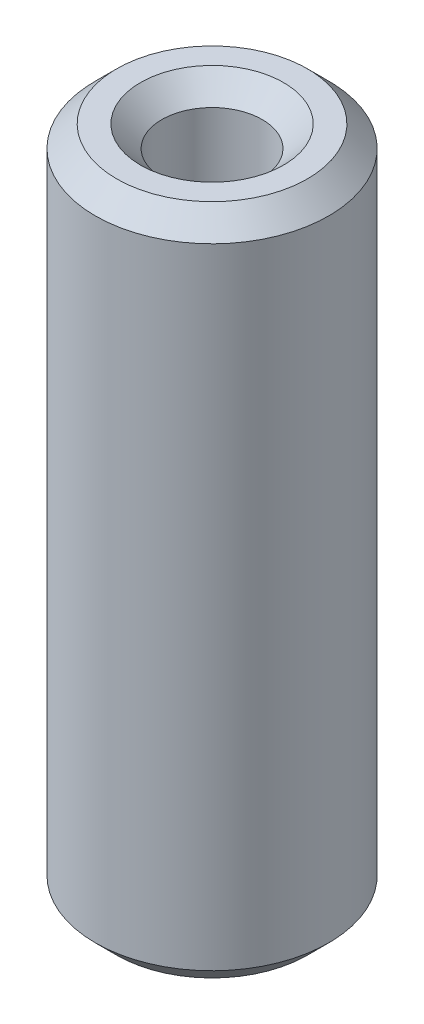
ISO-10303-21;
HEADER;
FILE_DESCRIPTION(('STEP AP214'),'2;1');
FILE_NAME('part.step','',(''),(''),'','','');
FILE_SCHEMA(('AUTOMOTIVE_DESIGN { 1 0 10303 214 1 1 1 1 }'));
ENDSEC;
DATA;
#1=APPLICATION_CONTEXT('core data for automotive mechanical design processes');
#2=APPLICATION_PROTOCOL_DEFINITION('international standard','automotive_design',2000,#1);
#3=PRODUCT_CONTEXT('',#1,'mechanical');
#4=PRODUCT('Part','Part','',(#3));
#5=PRODUCT_RELATED_PRODUCT_CATEGORY('part','',(#4));
#6=PRODUCT_DEFINITION_FORMATION('','',#4);
#7=PRODUCT_DEFINITION_CONTEXT('part definition',#1,'design');
#8=PRODUCT_DEFINITION('design','',#6,#7);
#9=PRODUCT_DEFINITION_SHAPE('','',#8);
#10=(LENGTH_UNIT() NAMED_UNIT(*) SI_UNIT(.MILLI.,.METRE.));
#11=(NAMED_UNIT(*) PLANE_ANGLE_UNIT() SI_UNIT($,.RADIAN.));
#12=(NAMED_UNIT(*) SI_UNIT($,.STERADIAN.) SOLID_ANGLE_UNIT());
#13=UNCERTAINTY_MEASURE_WITH_UNIT(LENGTH_MEASURE(1.E-05),#10,'distance_accuracy_value','');
#14=(GEOMETRIC_REPRESENTATION_CONTEXT(3) GLOBAL_UNCERTAINTY_ASSIGNED_CONTEXT((#13)) GLOBAL_UNIT_ASSIGNED_CONTEXT((#10,
#11,#12)) REPRESENTATION_CONTEXT('',''));
#15=CARTESIAN_POINT('',(0.,0.,0.));
#16=DIRECTION('',(0.,0.,1.));
#17=DIRECTION('',(1.,0.,0.));
#18=AXIS2_PLACEMENT_3D('',#15,#16,#17);
#19=CARTESIAN_POINT('',(0.,100.765719704849,0.));
#20=DIRECTION('',(0.,-1.,0.));
#21=DIRECTION('',(0.,0.,-1.));
#22=AXIS2_PLACEMENT_3D('',#19,#20,#21);
#23=CYLINDRICAL_SURFACE('',#22,17.5);
#24=CARTESIAN_POINT('',(0.,3.20181705302647,0.));
#25=DIRECTION('',(0.,1.,0.));
#26=DIRECTION('',(0.,0.,1.));
#27=AXIS2_PLACEMENT_3D('',#24,#25,#26);
#28=CIRCLE('',#27,17.5);
#29=CARTESIAN_POINT('',(0.,3.20181705302647,17.5));
#30=VERTEX_POINT('',#29);
#31=EDGE_CURVE('E10',#30,#30,#28,.T.);
#32=ORIENTED_EDGE('',*,*,#31,.T.);
#33=EDGE_LOOP('',(#32));
#34=FACE_BOUND('',#33,.T.);
#35=CARTESIAN_POINT('',(0.,97.5639026518224,0.));
#36=DIRECTION('',(0.,1.,0.));
#37=DIRECTION('',(0.,0.,1.));
#38=AXIS2_PLACEMENT_3D('',#35,#36,#37);
#39=CIRCLE('',#38,17.5);
#40=CARTESIAN_POINT('',(0.,97.5639026518224,17.5));
#41=VERTEX_POINT('',#40);
#42=EDGE_CURVE('E50',#41,#41,#39,.F.);
#43=ORIENTED_EDGE('',*,*,#42,.T.);
#44=EDGE_LOOP('',(#43));
#45=FACE_BOUND('',#44,.T.);
#46=ADVANCED_FACE('F39',(#34,#45),#23,.T.);
#47=CARTESIAN_POINT('',(0.,100.765719704849,0.));
#48=DIRECTION('',(0.,1.,0.));
#49=DIRECTION('',(0.,0.,1.));
#50=AXIS2_PLACEMENT_3D('',#47,#48,#49);
#51=PLANE('',#50);
#52=CARTESIAN_POINT('',(0.,100.765719704849,0.));
#53=DIRECTION('',(0.,1.,0.));
#54=DIRECTION('',(0.,0.,1.));
#55=AXIS2_PLACEMENT_3D('',#52,#53,#54);
#56=CIRCLE('',#55,10.7248258635014);
#57=CARTESIAN_POINT('',(0.,100.765719704849,10.7248258635014));
#58=VERTEX_POINT('',#57);
#59=EDGE_CURVE('E58',#58,#58,#56,.F.);
#60=ORIENTED_EDGE('',*,*,#59,.T.);
#61=EDGE_LOOP('',(#60));
#62=FACE_BOUND('',#61,.T.);
#63=CARTESIAN_POINT('',(0.,100.765719704849,0.));
#64=DIRECTION('',(0.,1.,0.));
#65=DIRECTION('',(0.,0.,1.));
#66=AXIS2_PLACEMENT_3D('',#63,#64,#65);
#67=CIRCLE('',#66,14.2981829469735);
#68=CARTESIAN_POINT('',(0.,100.765719704849,14.2981829469735));
#69=VERTEX_POINT('',#68);
#70=EDGE_CURVE('E61',#69,#69,#67,.T.);
#71=ORIENTED_EDGE('',*,*,#70,.T.);
#72=EDGE_LOOP('',(#71));
#73=FACE_BOUND('',#72,.T.);
#74=ADVANCED_FACE('F88',(#62,#73),#51,.T.);
#75=CARTESIAN_POINT('',(0.,0.,0.));
#76=DIRECTION('',(0.,1.,0.));
#77=DIRECTION('',(0.,0.,1.));
#78=AXIS2_PLACEMENT_3D('',#75,#76,#77);
#79=PLANE('',#78);
#80=CARTESIAN_POINT('',(0.,0.,0.));
#81=DIRECTION('',(0.,1.,0.));
#82=DIRECTION('',(0.,0.,1.));
#83=AXIS2_PLACEMENT_3D('',#80,#81,#82);
#84=CIRCLE('',#83,10.7248258635014);
#85=CARTESIAN_POINT('',(0.,0.,10.7248258635014));
#86=VERTEX_POINT('',#85);
#87=EDGE_CURVE('E51',#86,#86,#84,.T.);
#88=ORIENTED_EDGE('',*,*,#87,.T.);
#89=EDGE_LOOP('',(#88));
#90=FACE_BOUND('',#89,.T.);
#91=CARTESIAN_POINT('',(0.,0.,0.));
#92=DIRECTION('',(0.,1.,0.));
#93=DIRECTION('',(0.,0.,1.));
#94=AXIS2_PLACEMENT_3D('',#91,#92,#93);
#95=CIRCLE('',#94,14.2981829469735);
#96=CARTESIAN_POINT('',(0.,0.,14.2981829469735));
#97=VERTEX_POINT('',#96);
#98=EDGE_CURVE('E54',#97,#97,#95,.F.);
#99=ORIENTED_EDGE('',*,*,#98,.T.);
#100=EDGE_LOOP('',(#99));
#101=FACE_BOUND('',#100,.T.);
#102=ADVANCED_FACE('F83',(#90,#101),#79,.F.);
#103=CARTESIAN_POINT('',(0.,100.765719704849,0.));
#104=DIRECTION('',(0.,-1.,0.));
#105=DIRECTION('',(0.,0.,-1.));
#106=AXIS2_PLACEMENT_3D('',#103,#104,#105);
#107=CYLINDRICAL_SURFACE('',#106,7.52300881047491);
#108=CARTESIAN_POINT('',(0.,97.5639026518224,0.));
#109=DIRECTION('',(0.,1.,0.));
#110=DIRECTION('',(0.,0.,1.));
#111=AXIS2_PLACEMENT_3D('',#108,#109,#110);
#112=CIRCLE('',#111,7.52300881047491);
#113=CARTESIAN_POINT('',(0.,97.5639026518224,7.52300881047491));
#114=VERTEX_POINT('',#113);
#115=EDGE_CURVE('E67',#114,#114,#112,.T.);
#116=ORIENTED_EDGE('',*,*,#115,.T.);
#117=EDGE_LOOP('',(#116));
#118=FACE_BOUND('',#117,.T.);
#119=CARTESIAN_POINT('',(0.,3.2018170530265,0.));
#120=DIRECTION('',(0.,1.,0.));
#121=DIRECTION('',(0.,0.,1.));
#122=AXIS2_PLACEMENT_3D('',#119,#120,#121);
#123=CIRCLE('',#122,7.52300881047491);
#124=CARTESIAN_POINT('',(0.,3.2018170530265,7.52300881047491));
#125=VERTEX_POINT('',#124);
#126=EDGE_CURVE('E69',#125,#125,#123,.F.);
#127=ORIENTED_EDGE('',*,*,#126,.T.);
#128=EDGE_LOOP('',(#127));
#129=FACE_BOUND('',#128,.T.);
#130=ADVANCED_FACE('F71',(#118,#129),#107,.F.);
#131=CARTESIAN_POINT('',(0.,97.5639026518224,0.));
#132=DIRECTION('',(0.,1.,0.));
#133=DIRECTION('',(0.,0.,1.));
#134=AXIS2_PLACEMENT_3D('',#131,#132,#133);
#135=CONICAL_SURFACE('',#134,7.52300881047491,0.785398163397452);
#136=ORIENTED_EDGE('',*,*,#59,.F.);
#137=EDGE_LOOP('',(#136));
#138=FACE_BOUND('',#137,.T.);
#139=ORIENTED_EDGE('',*,*,#115,.F.);
#140=EDGE_LOOP('',(#139));
#141=FACE_BOUND('',#140,.T.);
#142=ADVANCED_FACE('F77',(#138,#141),#135,.F.);
#143=CARTESIAN_POINT('',(0.,0.,0.));
#144=DIRECTION('',(0.,-1.,0.));
#145=DIRECTION('',(0.,0.,-1.));
#146=AXIS2_PLACEMENT_3D('',#143,#144,#145);
#147=CONICAL_SURFACE('',#146,10.7248258635014,0.785398163397444);
#148=ORIENTED_EDGE('',*,*,#126,.F.);
#149=EDGE_LOOP('',(#148));
#150=FACE_BOUND('',#149,.T.);
#151=ORIENTED_EDGE('',*,*,#87,.F.);
#152=EDGE_LOOP('',(#151));
#153=FACE_BOUND('',#152,.T.);
#154=ADVANCED_FACE('F73',(#150,#153),#147,.F.);
#155=CARTESIAN_POINT('',(0.,3.20181705302647,0.));
#156=DIRECTION('',(0.,1.,0.));
#157=DIRECTION('',(0.,0.,1.));
#158=AXIS2_PLACEMENT_3D('',#155,#156,#157);
#159=CONICAL_SURFACE('',#158,17.5,0.785398163397451);
#160=ORIENTED_EDGE('',*,*,#98,.F.);
#161=EDGE_LOOP('',(#160));
#162=FACE_BOUND('',#161,.T.);
#163=ORIENTED_EDGE('',*,*,#31,.F.);
#164=EDGE_LOOP('',(#163));
#165=FACE_BOUND('',#164,.T.);
#166=ADVANCED_FACE('F76',(#162,#165),#159,.T.);
#167=CARTESIAN_POINT('',(0.,100.765719704849,0.));
#168=DIRECTION('',(0.,-1.,0.));
#169=DIRECTION('',(0.,0.,-1.));
#170=AXIS2_PLACEMENT_3D('',#167,#168,#169);
#171=CONICAL_SURFACE('',#170,14.2981829469735,0.785398163397445);
#172=ORIENTED_EDGE('',*,*,#42,.F.);
#173=EDGE_LOOP('',(#172));
#174=FACE_BOUND('',#173,.T.);
#175=ORIENTED_EDGE('',*,*,#70,.F.);
#176=EDGE_LOOP('',(#175));
#177=FACE_BOUND('',#176,.T.);
#178=ADVANCED_FACE('F45',(#174,#177),#171,.T.);
#179=CLOSED_SHELL('',(#46,#74,#102,#130,#142,#154,#166,#178));
#180=MANIFOLD_SOLID_BREP('B2',#179);
#181=ADVANCED_BREP_SHAPE_REPRESENTATION('',(#18,#180),#14);
#182=SHAPE_DEFINITION_REPRESENTATION(#9,#181);
ENDSEC;
END-ISO-10303-21;
